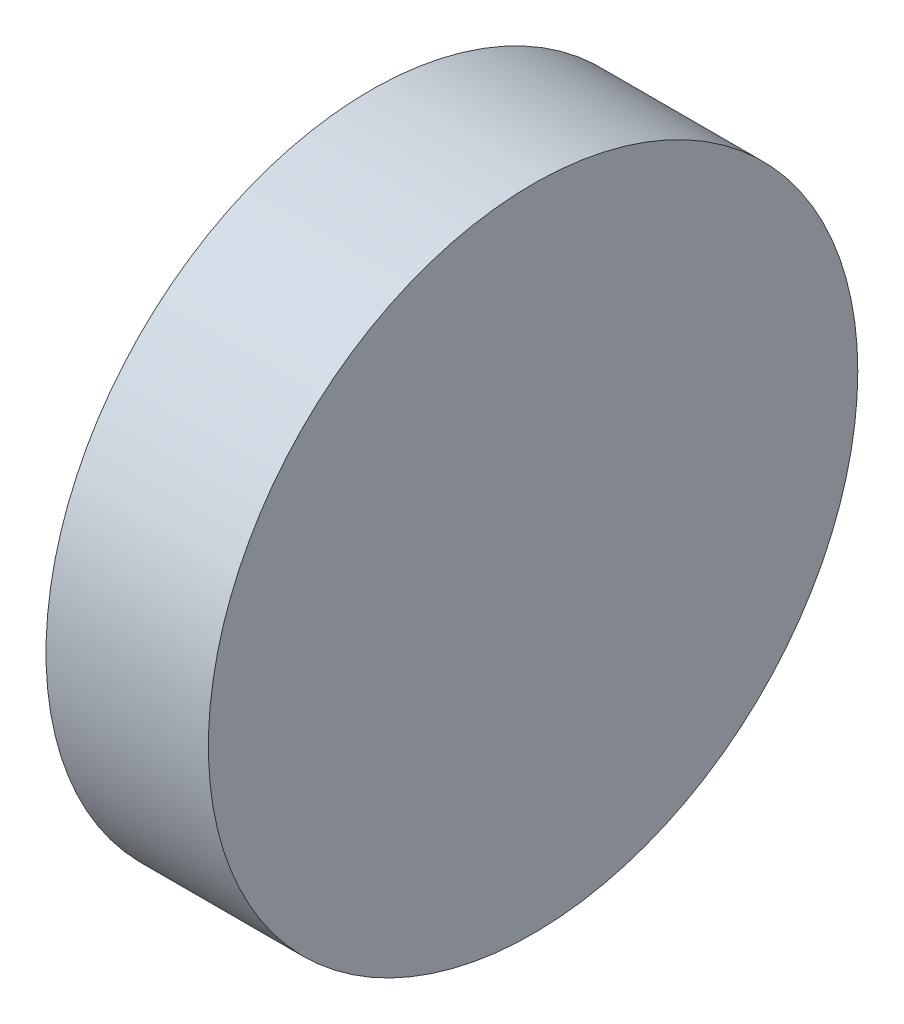
ISO-10303-21;
HEADER;
FILE_DESCRIPTION(('STEP AP214'),'2;1');
FILE_NAME('part.step','',(''),(''),'','','');
FILE_SCHEMA(('AUTOMOTIVE_DESIGN { 1 0 10303 214 1 1 1 1 }'));
ENDSEC;
DATA;
#1=APPLICATION_CONTEXT('core data for automotive mechanical design processes');
#2=APPLICATION_PROTOCOL_DEFINITION('international standard','automotive_design',2000,#1);
#3=PRODUCT_CONTEXT('',#1,'mechanical');
#4=PRODUCT('Part','Part','',(#3));
#5=PRODUCT_RELATED_PRODUCT_CATEGORY('part','',(#4));
#6=PRODUCT_DEFINITION_FORMATION('','',#4);
#7=PRODUCT_DEFINITION_CONTEXT('part definition',#1,'design');
#8=PRODUCT_DEFINITION('design','',#6,#7);
#9=PRODUCT_DEFINITION_SHAPE('','',#8);
#10=(LENGTH_UNIT() NAMED_UNIT(*) SI_UNIT(.MILLI.,.METRE.));
#11=(NAMED_UNIT(*) PLANE_ANGLE_UNIT() SI_UNIT($,.RADIAN.));
#12=(NAMED_UNIT(*) SI_UNIT($,.STERADIAN.) SOLID_ANGLE_UNIT());
#13=UNCERTAINTY_MEASURE_WITH_UNIT(LENGTH_MEASURE(1.E-05),#10,'distance_accuracy_value','');
#14=(GEOMETRIC_REPRESENTATION_CONTEXT(3) GLOBAL_UNCERTAINTY_ASSIGNED_CONTEXT((#13)) GLOBAL_UNIT_ASSIGNED_CONTEXT((#10,
#11,#12)) REPRESENTATION_CONTEXT('',''));
#15=CARTESIAN_POINT('',(0.,0.,0.));
#16=DIRECTION('',(0.,0.,1.));
#17=DIRECTION('',(1.,0.,0.));
#18=AXIS2_PLACEMENT_3D('',#15,#16,#17);
#19=CARTESIAN_POINT('',(76.2,0.,0.));
#20=DIRECTION('',(-1.,0.,0.));
#21=DIRECTION('',(0.,0.,1.));
#22=AXIS2_PLACEMENT_3D('',#19,#20,#21);
#23=CYLINDRICAL_SURFACE('',#22,152.4);
#24=CARTESIAN_POINT('',(76.2,0.,0.));
#25=DIRECTION('',(1.,0.,0.));
#26=DIRECTION('',(0.,0.,-1.));
#27=AXIS2_PLACEMENT_3D('',#24,#25,#26);
#28=CIRCLE('',#27,152.4);
#29=CARTESIAN_POINT('',(76.2,0.,-152.4));
#30=VERTEX_POINT('',#29);
#31=EDGE_CURVE('E10',#30,#30,#28,.T.);
#32=ORIENTED_EDGE('',*,*,#31,.F.);
#33=EDGE_LOOP('',(#32));
#34=FACE_BOUND('',#33,.T.);
#35=CARTESIAN_POINT('',(0.,0.,0.));
#36=DIRECTION('',(1.,0.,0.));
#37=DIRECTION('',(0.,0.,-1.));
#38=AXIS2_PLACEMENT_3D('',#35,#36,#37);
#39=CIRCLE('',#38,152.4);
#40=CARTESIAN_POINT('',(0.,0.,-152.4));
#41=VERTEX_POINT('',#40);
#42=EDGE_CURVE('E34',#41,#41,#39,.T.);
#43=ORIENTED_EDGE('',*,*,#42,.T.);
#44=EDGE_LOOP('',(#43));
#45=FACE_BOUND('',#44,.T.);
#46=ADVANCED_FACE('F31',(#34,#45),#23,.T.);
#47=CARTESIAN_POINT('',(76.2,0.,0.));
#48=DIRECTION('',(1.,0.,0.));
#49=DIRECTION('',(0.,0.,-1.));
#50=AXIS2_PLACEMENT_3D('',#47,#48,#49);
#51=PLANE('',#50);
#52=ORIENTED_EDGE('',*,*,#31,.T.);
#53=EDGE_LOOP('',(#52));
#54=FACE_BOUND('',#53,.T.);
#55=ADVANCED_FACE('F46',(#54),#51,.T.);
#56=CARTESIAN_POINT('',(0.,0.,0.));
#57=DIRECTION('',(1.,0.,0.));
#58=DIRECTION('',(0.,0.,-1.));
#59=AXIS2_PLACEMENT_3D('',#56,#57,#58);
#60=PLANE('',#59);
#61=ORIENTED_EDGE('',*,*,#42,.F.);
#62=EDGE_LOOP('',(#61));
#63=FACE_BOUND('',#62,.T.);
#64=ADVANCED_FACE('F44',(#63),#60,.F.);
#65=CLOSED_SHELL('',(#46,#55,#64));
#66=MANIFOLD_SOLID_BREP('B2',#65);
#67=ADVANCED_BREP_SHAPE_REPRESENTATION('',(#18,#66),#14);
#68=SHAPE_DEFINITION_REPRESENTATION(#9,#67);
ENDSEC;
END-ISO-10303-21;
